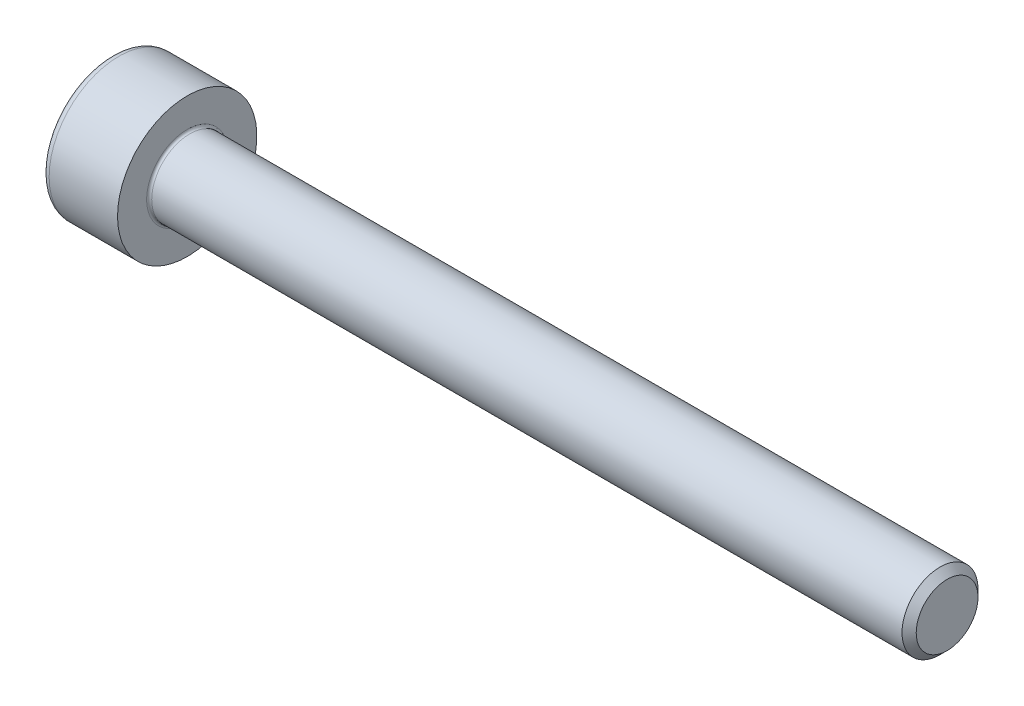
ISO-10303-21;
HEADER;
FILE_DESCRIPTION(('STEP AP214'),'2;1');
FILE_NAME('part.step','',(''),(''),'','','');
FILE_SCHEMA(('AUTOMOTIVE_DESIGN { 1 0 10303 214 1 1 1 1 }'));
ENDSEC;
DATA;
#1=APPLICATION_CONTEXT('core data for automotive mechanical design processes');
#2=APPLICATION_PROTOCOL_DEFINITION('international standard','automotive_design',2000,#1);
#3=PRODUCT_CONTEXT('',#1,'mechanical');
#4=PRODUCT('Part','Part','',(#3));
#5=PRODUCT_RELATED_PRODUCT_CATEGORY('part','',(#4));
#6=PRODUCT_DEFINITION_FORMATION('','',#4);
#7=PRODUCT_DEFINITION_CONTEXT('part definition',#1,'design');
#8=PRODUCT_DEFINITION('design','',#6,#7);
#9=PRODUCT_DEFINITION_SHAPE('','',#8);
#10=(LENGTH_UNIT() NAMED_UNIT(*) SI_UNIT(.MILLI.,.METRE.));
#11=(NAMED_UNIT(*) PLANE_ANGLE_UNIT() SI_UNIT($,.RADIAN.));
#12=(NAMED_UNIT(*) SI_UNIT($,.STERADIAN.) SOLID_ANGLE_UNIT());
#13=UNCERTAINTY_MEASURE_WITH_UNIT(LENGTH_MEASURE(1.E-05),#10,'distance_accuracy_value','');
#14=(GEOMETRIC_REPRESENTATION_CONTEXT(3) GLOBAL_UNCERTAINTY_ASSIGNED_CONTEXT((#13)) GLOBAL_UNIT_ASSIGNED_CONTEXT((#10,
#11,#12)) REPRESENTATION_CONTEXT('',''));
#15=CARTESIAN_POINT('',(0.,0.,0.));
#16=DIRECTION('',(0.,0.,1.));
#17=DIRECTION('',(1.,0.,0.));
#18=AXIS2_PLACEMENT_3D('',#15,#16,#17);
#19=CARTESIAN_POINT('',(0.,0.,0.));
#20=DIRECTION('',(-1.,0.,0.));
#21=DIRECTION('',(0.,0.,1.));
#22=AXIS2_PLACEMENT_3D('',#19,#20,#21);
#23=PLANE('',#22);
#24=DIRECTION('',(0.,-0.499999999999999,0.866025403784439));
#25=VECTOR('',#24,1.);
#26=CARTESIAN_POINT('',(0.,1.45492267835785,0.));
#27=LINE('',#26,#25);
#28=CARTESIAN_POINT('',(0.,1.45492267835785,0.));
#29=VERTEX_POINT('',#28);
#30=CARTESIAN_POINT('',(0.,0.727461339178922,1.26));
#31=VERTEX_POINT('',#30);
#32=EDGE_CURVE('E259',#29,#31,#27,.T.);
#33=ORIENTED_EDGE('',*,*,#32,.T.);
#34=DIRECTION('',(0.,1.,0.));
#35=VECTOR('',#34,1.);
#36=CARTESIAN_POINT('',(0.,-0.727461339178934,1.26));
#37=LINE('',#36,#35);
#38=CARTESIAN_POINT('',(0.,-0.727461339178934,1.26));
#39=VERTEX_POINT('',#38);
#40=EDGE_CURVE('E131',#39,#31,#37,.T.);
#41=ORIENTED_EDGE('',*,*,#40,.F.);
#42=DIRECTION('',(0.,-0.500000000000001,-0.866025403784438));
#43=VECTOR('',#42,1.);
#44=CARTESIAN_POINT('',(0.,-0.727461339178934,1.26));
#45=LINE('',#44,#43);
#46=CARTESIAN_POINT('',(0.,-1.45492267835786,0.));
#47=VERTEX_POINT('',#46);
#48=EDGE_CURVE('E262',#39,#47,#45,.T.);
#49=ORIENTED_EDGE('',*,*,#48,.T.);
#50=DIRECTION('',(0.,0.499999999999998,-0.86602540378444));
#51=VECTOR('',#50,1.);
#52=CARTESIAN_POINT('',(0.,-1.45492267835786,0.));
#53=LINE('',#52,#51);
#54=CARTESIAN_POINT('',(0.,-0.727461339178938,-1.26));
#55=VERTEX_POINT('',#54);
#56=EDGE_CURVE('E265',#47,#55,#53,.T.);
#57=ORIENTED_EDGE('',*,*,#56,.T.);
#58=DIRECTION('',(0.,-1.,0.));
#59=VECTOR('',#58,1.);
#60=CARTESIAN_POINT('',(0.,0.727461339178918,-1.26));
#61=LINE('',#60,#59);
#62=CARTESIAN_POINT('',(0.,0.727461339178918,-1.26));
#63=VERTEX_POINT('',#62);
#64=EDGE_CURVE('E268',#63,#55,#61,.T.);
#65=ORIENTED_EDGE('',*,*,#64,.F.);
#66=DIRECTION('',(0.,-0.500000000000001,-0.866025403784438));
#67=VECTOR('',#66,1.);
#68=CARTESIAN_POINT('',(0.,1.45492267835785,0.));
#69=LINE('',#68,#67);
#70=EDGE_CURVE('E126',#29,#63,#69,.T.);
#71=ORIENTED_EDGE('',*,*,#70,.F.);
#72=EDGE_LOOP('',(#33,#41,#49,#57,#65,#71));
#73=FACE_BOUND('',#72,.T.);
#74=CARTESIAN_POINT('',(0.,0.,0.));
#75=DIRECTION('',(-1.,0.,0.));
#76=DIRECTION('',(0.,0.,1.));
#77=AXIS2_PLACEMENT_3D('',#74,#75,#76);
#78=CIRCLE('',#77,2.45);
#79=CARTESIAN_POINT('',(0.,0.,2.45));
#80=VERTEX_POINT('',#79);
#81=EDGE_CURVE('E43',#80,#80,#78,.T.);
#82=ORIENTED_EDGE('',*,*,#81,.T.);
#83=EDGE_LOOP('',(#82));
#84=FACE_BOUND('',#83,.T.);
#85=ADVANCED_FACE('F35',(#73,#84),#23,.T.);
#86=CARTESIAN_POINT('',(-31.75,0.,0.));
#87=DIRECTION('',(-1.,0.,0.));
#88=DIRECTION('',(0.,0.,1.));
#89=AXIS2_PLACEMENT_3D('',#86,#87,#88);
#90=CYLINDRICAL_SURFACE('',#89,2.75);
#91=CARTESIAN_POINT('',(0.300000000000002,0.,0.));
#92=DIRECTION('',(-1.,0.,0.));
#93=DIRECTION('',(0.,0.,1.));
#94=AXIS2_PLACEMENT_3D('',#91,#92,#93);
#95=CIRCLE('',#94,2.75);
#96=CARTESIAN_POINT('',(0.300000000000002,0.,2.75));
#97=VERTEX_POINT('',#96);
#98=EDGE_CURVE('E11',#97,#97,#95,.F.);
#99=ORIENTED_EDGE('',*,*,#98,.T.);
#100=EDGE_LOOP('',(#99));
#101=FACE_BOUND('',#100,.T.);
#102=CARTESIAN_POINT('',(3.,0.,0.));
#103=DIRECTION('',(-1.,0.,0.));
#104=DIRECTION('',(0.,0.,1.));
#105=AXIS2_PLACEMENT_3D('',#102,#103,#104);
#106=CIRCLE('',#105,2.75);
#107=CARTESIAN_POINT('',(3.,0.,2.75));
#108=VERTEX_POINT('',#107);
#109=EDGE_CURVE('E149',#108,#108,#106,.T.);
#110=ORIENTED_EDGE('',*,*,#109,.T.);
#111=EDGE_LOOP('',(#110));
#112=FACE_BOUND('',#111,.T.);
#113=ADVANCED_FACE('F173',(#101,#112),#90,.T.);
#114=CARTESIAN_POINT('',(3.,2.75,0.));
#115=DIRECTION('',(1.,0.,0.));
#116=DIRECTION('',(0.,0.,-1.));
#117=AXIS2_PLACEMENT_3D('',#114,#115,#116);
#118=PLANE('',#117);
#119=CARTESIAN_POINT('',(3.,0.,0.));
#120=DIRECTION('',(1.,0.,0.));
#121=DIRECTION('',(0.,0.,-1.));
#122=AXIS2_PLACEMENT_3D('',#119,#120,#121);
#123=CIRCLE('',#122,1.59999999999995);
#124=CARTESIAN_POINT('',(3.,0.,-1.59999999999995));
#125=VERTEX_POINT('',#124);
#126=EDGE_CURVE('E152',#125,#125,#123,.F.);
#127=ORIENTED_EDGE('',*,*,#126,.T.);
#128=EDGE_LOOP('',(#127));
#129=FACE_BOUND('',#128,.T.);
#130=ORIENTED_EDGE('',*,*,#109,.F.);
#131=EDGE_LOOP('',(#130));
#132=FACE_BOUND('',#131,.T.);
#133=ADVANCED_FACE('F179',(#129,#132),#118,.T.);
#134=CARTESIAN_POINT('',(-31.75,0.,0.));
#135=DIRECTION('',(-1.,0.,0.));
#136=DIRECTION('',(0.,0.,1.));
#137=AXIS2_PLACEMENT_3D('',#134,#135,#136);
#138=CYLINDRICAL_SURFACE('',#137,1.49999999999994);
#139=CARTESIAN_POINT('',(3.1,0.,0.));
#140=DIRECTION('',(1.,0.,0.));
#141=DIRECTION('',(0.,0.,-1.));
#142=AXIS2_PLACEMENT_3D('',#139,#140,#141);
#143=CIRCLE('',#142,1.49999999999994);
#144=CARTESIAN_POINT('',(3.1,0.,-1.49999999999994));
#145=VERTEX_POINT('',#144);
#146=EDGE_CURVE('E155',#145,#145,#143,.T.);
#147=ORIENTED_EDGE('',*,*,#146,.T.);
#148=EDGE_LOOP('',(#147));
#149=FACE_BOUND('',#148,.T.);
#150=CARTESIAN_POINT('',(32.7194999999999,0.,0.));
#151=DIRECTION('',(-1.,0.,0.));
#152=DIRECTION('',(0.,0.,1.));
#153=AXIS2_PLACEMENT_3D('',#150,#151,#152);
#154=CIRCLE('',#153,1.49999999999989);
#155=CARTESIAN_POINT('',(32.7194999999999,0.,1.49999999999989));
#156=VERTEX_POINT('',#155);
#157=EDGE_CURVE('E146',#156,#156,#154,.T.);
#158=ORIENTED_EDGE('',*,*,#157,.T.);
#159=EDGE_LOOP('',(#158));
#160=FACE_BOUND('',#159,.T.);
#161=ADVANCED_FACE('F185',(#149,#160),#138,.T.);
#162=CARTESIAN_POINT('',(33.,0.,0.));
#163=DIRECTION('',(-1.,0.,0.));
#164=DIRECTION('',(0.,0.,1.));
#165=AXIS2_PLACEMENT_3D('',#162,#163,#164);
#166=CONICAL_SURFACE('',#165,1.2195,0.785398163397049);
#167=ORIENTED_EDGE('',*,*,#157,.F.);
#168=EDGE_LOOP('',(#167));
#169=FACE_BOUND('',#168,.T.);
#170=CARTESIAN_POINT('',(33.,0.,0.));
#171=DIRECTION('',(-1.,0.,0.));
#172=DIRECTION('',(0.,0.,1.));
#173=AXIS2_PLACEMENT_3D('',#170,#171,#172);
#174=CIRCLE('',#173,1.2195);
#175=CARTESIAN_POINT('',(33.,0.,1.2195));
#176=VERTEX_POINT('',#175);
#177=EDGE_CURVE('E142',#176,#176,#174,.T.);
#178=ORIENTED_EDGE('',*,*,#177,.T.);
#179=EDGE_LOOP('',(#178));
#180=FACE_BOUND('',#179,.T.);
#181=ADVANCED_FACE('F189',(#169,#180),#166,.T.);
#182=CARTESIAN_POINT('',(33.,1.2195,0.));
#183=DIRECTION('',(1.,0.,0.));
#184=DIRECTION('',(0.,0.,-1.));
#185=AXIS2_PLACEMENT_3D('',#182,#183,#184);
#186=PLANE('',#185);
#187=ORIENTED_EDGE('',*,*,#177,.F.);
#188=EDGE_LOOP('',(#187));
#189=FACE_BOUND('',#188,.T.);
#190=ADVANCED_FACE('F169',(#189),#186,.T.);
#191=CARTESIAN_POINT('',(3.1,0.,0.));
#192=DIRECTION('',(1.,0.,0.));
#193=DIRECTION('',(0.,0.,-1.));
#194=AXIS2_PLACEMENT_3D('',#191,#192,#193);
#195=TOROIDAL_SURFACE('',#194,1.59999999999995,0.1);
#196=ORIENTED_EDGE('',*,*,#146,.F.);
#197=EDGE_LOOP('',(#196));
#198=FACE_BOUND('',#197,.T.);
#199=ORIENTED_EDGE('',*,*,#126,.F.);
#200=EDGE_LOOP('',(#199));
#201=FACE_BOUND('',#200,.T.);
#202=ADVANCED_FACE('F162',(#198,#201),#195,.F.);
#203=CARTESIAN_POINT('',(0.300000000000002,0.,0.));
#204=DIRECTION('',(-1.,0.,0.));
#205=DIRECTION('',(0.,0.,1.));
#206=AXIS2_PLACEMENT_3D('',#203,#204,#205);
#207=TOROIDAL_SURFACE('',#206,2.45,0.3);
#208=ORIENTED_EDGE('',*,*,#98,.F.);
#209=EDGE_LOOP('',(#208));
#210=FACE_BOUND('',#209,.T.);
#211=ORIENTED_EDGE('',*,*,#81,.F.);
#212=EDGE_LOOP('',(#211));
#213=FACE_BOUND('',#212,.T.);
#214=ADVANCED_FACE('F37',(#210,#213),#207,.T.);
#215=CARTESIAN_POINT('',(1.3,1.45492267835785,0.));
#216=DIRECTION('',(0.,-0.866025403784439,-0.499999999999999));
#217=DIRECTION('',(0.,0.499999999999999,-0.866025403784439));
#218=AXIS2_PLACEMENT_3D('',#215,#216,#217);
#219=PLANE('',#218);
#220=ORIENTED_EDGE('',*,*,#32,.F.);
#221=DIRECTION('',(-1.,0.,0.));
#222=VECTOR('',#221,1.);
#223=CARTESIAN_POINT('',(1.3,1.45492267835785,0.));
#224=LINE('',#223,#222);
#225=CARTESIAN_POINT('',(1.3,1.45492267835785,0.));
#226=VERTEX_POINT('',#225);
#227=EDGE_CURVE('E249',#226,#29,#224,.T.);
#228=ORIENTED_EDGE('',*,*,#227,.F.);
#229=DIRECTION('',(0.,-0.499999999999999,0.866025403784439));
#230=VECTOR('',#229,1.);
#231=CARTESIAN_POINT('',(1.3,1.45492267835785,0.));
#232=LINE('',#231,#230);
#233=CARTESIAN_POINT('',(1.3,1.09119200876839,0.629999999999996));
#234=VERTEX_POINT('',#233);
#235=EDGE_CURVE('E118',#226,#234,#232,.T.);
#236=ORIENTED_EDGE('',*,*,#235,.T.);
#237=CARTESIAN_POINT('',(1.3,0.727461339178922,1.26));
#238=VERTEX_POINT('',#237);
#239=EDGE_CURVE('E109',#234,#238,#232,.T.);
#240=ORIENTED_EDGE('',*,*,#239,.T.);
#241=DIRECTION('',(-1.,0.,0.));
#242=VECTOR('',#241,1.);
#243=CARTESIAN_POINT('',(1.3,0.727461339178922,1.26));
#244=LINE('',#243,#242);
#245=EDGE_CURVE('E123',#238,#31,#244,.T.);
#246=ORIENTED_EDGE('',*,*,#245,.T.);
#247=EDGE_LOOP('',(#220,#228,#236,#240,#246));
#248=FACE_BOUND('',#247,.T.);
#249=ADVANCED_FACE('F122',(#248),#219,.T.);
#250=CARTESIAN_POINT('',(1.3,-0.727461339178934,1.26));
#251=DIRECTION('',(0.,0.,1.));
#252=DIRECTION('',(0.,-1.,0.));
#253=AXIS2_PLACEMENT_3D('',#250,#251,#252);
#254=PLANE('',#253);
#255=ORIENTED_EDGE('',*,*,#40,.T.);
#256=ORIENTED_EDGE('',*,*,#245,.F.);
#257=DIRECTION('',(0.,1.,0.));
#258=VECTOR('',#257,1.);
#259=CARTESIAN_POINT('',(1.3,-0.727461339178934,1.26));
#260=LINE('',#259,#258);
#261=CARTESIAN_POINT('',(1.3,0.,1.26));
#262=VERTEX_POINT('',#261);
#263=EDGE_CURVE('E106',#262,#238,#260,.T.);
#264=ORIENTED_EDGE('',*,*,#263,.F.);
#265=CARTESIAN_POINT('',(1.3,-0.727461339178934,1.26));
#266=VERTEX_POINT('',#265);
#267=EDGE_CURVE('E117',#266,#262,#260,.T.);
#268=ORIENTED_EDGE('',*,*,#267,.F.);
#269=DIRECTION('',(-1.,0.,0.));
#270=VECTOR('',#269,1.);
#271=CARTESIAN_POINT('',(1.3,-0.727461339178934,1.26));
#272=LINE('',#271,#270);
#273=EDGE_CURVE('E133',#266,#39,#272,.T.);
#274=ORIENTED_EDGE('',*,*,#273,.T.);
#275=EDGE_LOOP('',(#255,#256,#264,#268,#274));
#276=FACE_BOUND('',#275,.T.);
#277=ADVANCED_FACE('F128',(#276),#254,.F.);
#278=CARTESIAN_POINT('',(1.3,-0.727461339178934,1.26));
#279=DIRECTION('',(0.,0.866025403784438,-0.500000000000001));
#280=DIRECTION('',(0.,0.500000000000001,0.866025403784438));
#281=AXIS2_PLACEMENT_3D('',#278,#279,#280);
#282=PLANE('',#281);
#283=ORIENTED_EDGE('',*,*,#48,.F.);
#284=ORIENTED_EDGE('',*,*,#273,.F.);
#285=DIRECTION('',(0.,-0.500000000000001,-0.866025403784438));
#286=VECTOR('',#285,1.);
#287=CARTESIAN_POINT('',(1.3,-0.727461339178934,1.26));
#288=LINE('',#287,#286);
#289=CARTESIAN_POINT('',(1.3,-1.0911920087684,0.630000000000005));
#290=VERTEX_POINT('',#289);
#291=EDGE_CURVE('E288',#266,#290,#288,.T.);
#292=ORIENTED_EDGE('',*,*,#291,.T.);
#293=CARTESIAN_POINT('',(1.3,-1.45492267835786,0.));
#294=VERTEX_POINT('',#293);
#295=EDGE_CURVE('E277',#290,#294,#288,.T.);
#296=ORIENTED_EDGE('',*,*,#295,.T.);
#297=DIRECTION('',(-1.,0.,0.));
#298=VECTOR('',#297,1.);
#299=CARTESIAN_POINT('',(1.3,-1.45492267835786,0.));
#300=LINE('',#299,#298);
#301=EDGE_CURVE('E138',#294,#47,#300,.T.);
#302=ORIENTED_EDGE('',*,*,#301,.T.);
#303=EDGE_LOOP('',(#283,#284,#292,#296,#302));
#304=FACE_BOUND('',#303,.T.);
#305=ADVANCED_FACE('F203',(#304),#282,.T.);
#306=CARTESIAN_POINT('',(1.3,-1.45492267835786,0.));
#307=DIRECTION('',(0.,0.86602540378444,0.499999999999998));
#308=DIRECTION('',(0.,-0.499999999999998,0.86602540378444));
#309=AXIS2_PLACEMENT_3D('',#306,#307,#308);
#310=PLANE('',#309);
#311=ORIENTED_EDGE('',*,*,#56,.F.);
#312=ORIENTED_EDGE('',*,*,#301,.F.);
#313=DIRECTION('',(0.,0.499999999999998,-0.86602540378444));
#314=VECTOR('',#313,1.);
#315=CARTESIAN_POINT('',(1.3,-1.45492267835786,0.));
#316=LINE('',#315,#314);
#317=CARTESIAN_POINT('',(1.3,-1.0911920087684,-0.63));
#318=VERTEX_POINT('',#317);
#319=EDGE_CURVE('E255',#294,#318,#316,.T.);
#320=ORIENTED_EDGE('',*,*,#319,.T.);
#321=CARTESIAN_POINT('',(1.3,-0.727461339178938,-1.26));
#322=VERTEX_POINT('',#321);
#323=EDGE_CURVE('E287',#318,#322,#316,.T.);
#324=ORIENTED_EDGE('',*,*,#323,.T.);
#325=DIRECTION('',(-1.,0.,0.));
#326=VECTOR('',#325,1.);
#327=CARTESIAN_POINT('',(1.3,-0.727461339178938,-1.26));
#328=LINE('',#327,#326);
#329=EDGE_CURVE('E248',#322,#55,#328,.T.);
#330=ORIENTED_EDGE('',*,*,#329,.T.);
#331=EDGE_LOOP('',(#311,#312,#320,#324,#330));
#332=FACE_BOUND('',#331,.T.);
#333=ADVANCED_FACE('F206',(#332),#310,.T.);
#334=CARTESIAN_POINT('',(1.3,0.727461339178918,-1.26));
#335=DIRECTION('',(0.,0.,-1.));
#336=DIRECTION('',(0.,1.,0.));
#337=AXIS2_PLACEMENT_3D('',#334,#335,#336);
#338=PLANE('',#337);
#339=ORIENTED_EDGE('',*,*,#64,.T.);
#340=ORIENTED_EDGE('',*,*,#329,.F.);
#341=DIRECTION('',(0.,-1.,0.));
#342=VECTOR('',#341,1.);
#343=CARTESIAN_POINT('',(1.3,0.727461339178918,-1.26));
#344=LINE('',#343,#342);
#345=CARTESIAN_POINT('',(1.3,0.,-1.26));
#346=VERTEX_POINT('',#345);
#347=EDGE_CURVE('E252',#346,#322,#344,.T.);
#348=ORIENTED_EDGE('',*,*,#347,.F.);
#349=CARTESIAN_POINT('',(1.3,0.727461339178918,-1.26));
#350=VERTEX_POINT('',#349);
#351=EDGE_CURVE('E50',#350,#346,#344,.T.);
#352=ORIENTED_EDGE('',*,*,#351,.F.);
#353=DIRECTION('',(-1.,0.,0.));
#354=VECTOR('',#353,1.);
#355=CARTESIAN_POINT('',(1.3,0.727461339178918,-1.26));
#356=LINE('',#355,#354);
#357=EDGE_CURVE('E245',#350,#63,#356,.T.);
#358=ORIENTED_EDGE('',*,*,#357,.T.);
#359=EDGE_LOOP('',(#339,#340,#348,#352,#358));
#360=FACE_BOUND('',#359,.T.);
#361=ADVANCED_FACE('F210',(#360),#338,.F.);
#362=CARTESIAN_POINT('',(1.3,1.45492267835785,0.));
#363=DIRECTION('',(0.,0.866025403784438,-0.500000000000001));
#364=DIRECTION('',(0.,0.500000000000001,0.866025403784438));
#365=AXIS2_PLACEMENT_3D('',#362,#363,#364);
#366=PLANE('',#365);
#367=ORIENTED_EDGE('',*,*,#70,.T.);
#368=ORIENTED_EDGE('',*,*,#357,.F.);
#369=DIRECTION('',(0.,-0.500000000000001,-0.866025403784438));
#370=VECTOR('',#369,1.);
#371=CARTESIAN_POINT('',(1.3,1.45492267835785,0.));
#372=LINE('',#371,#370);
#373=CARTESIAN_POINT('',(1.3,1.09119200876838,-0.629999999999997));
#374=VERTEX_POINT('',#373);
#375=EDGE_CURVE('E235',#374,#350,#372,.T.);
#376=ORIENTED_EDGE('',*,*,#375,.F.);
#377=EDGE_CURVE('E241',#226,#374,#372,.T.);
#378=ORIENTED_EDGE('',*,*,#377,.F.);
#379=ORIENTED_EDGE('',*,*,#227,.T.);
#380=EDGE_LOOP('',(#367,#368,#376,#378,#379));
#381=FACE_BOUND('',#380,.T.);
#382=ADVANCED_FACE('F214',(#381),#366,.F.);
#383=CARTESIAN_POINT('',(1.3,2.18238401753677,-1.26));
#384=DIRECTION('',(1.,0.,0.));
#385=DIRECTION('',(0.,0.,-1.));
#386=AXIS2_PLACEMENT_3D('',#383,#384,#385);
#387=PLANE('',#386);
#388=ORIENTED_EDGE('',*,*,#347,.T.);
#389=ORIENTED_EDGE('',*,*,#323,.F.);
#390=CARTESIAN_POINT('',(1.3,0.,0.));
#391=DIRECTION('',(-1.,0.,0.));
#392=DIRECTION('',(0.,0.,1.));
#393=AXIS2_PLACEMENT_3D('',#390,#391,#392);
#394=CIRCLE('',#393,1.26);
#395=EDGE_CURVE('E283',#346,#318,#394,.T.);
#396=ORIENTED_EDGE('',*,*,#395,.F.);
#397=EDGE_LOOP('',(#388,#389,#396));
#398=FACE_BOUND('',#397,.T.);
#399=ADVANCED_FACE('F218',(#398),#387,.F.);
#400=ORIENTED_EDGE('',*,*,#319,.F.);
#401=ORIENTED_EDGE('',*,*,#295,.F.);
#402=EDGE_CURVE('E136',#318,#290,#394,.T.);
#403=ORIENTED_EDGE('',*,*,#402,.F.);
#404=EDGE_LOOP('',(#400,#401,#403));
#405=FACE_BOUND('',#404,.T.);
#406=ADVANCED_FACE('F221',(#405),#387,.F.);
#407=ORIENTED_EDGE('',*,*,#291,.F.);
#408=ORIENTED_EDGE('',*,*,#267,.T.);
#409=EDGE_CURVE('E132',#290,#262,#394,.T.);
#410=ORIENTED_EDGE('',*,*,#409,.F.);
#411=EDGE_LOOP('',(#407,#408,#410));
#412=FACE_BOUND('',#411,.T.);
#413=ADVANCED_FACE('F226',(#412),#387,.F.);
#414=ORIENTED_EDGE('',*,*,#263,.T.);
#415=ORIENTED_EDGE('',*,*,#239,.F.);
#416=EDGE_CURVE('E112',#262,#234,#394,.T.);
#417=ORIENTED_EDGE('',*,*,#416,.F.);
#418=EDGE_LOOP('',(#414,#415,#417));
#419=FACE_BOUND('',#418,.T.);
#420=ADVANCED_FACE('F108',(#419),#387,.F.);
#421=ORIENTED_EDGE('',*,*,#235,.F.);
#422=ORIENTED_EDGE('',*,*,#377,.T.);
#423=EDGE_CURVE('E143',#234,#374,#394,.T.);
#424=ORIENTED_EDGE('',*,*,#423,.F.);
#425=EDGE_LOOP('',(#421,#422,#424));
#426=FACE_BOUND('',#425,.T.);
#427=ADVANCED_FACE('F229',(#426),#387,.F.);
#428=ORIENTED_EDGE('',*,*,#375,.T.);
#429=ORIENTED_EDGE('',*,*,#351,.T.);
#430=EDGE_CURVE('E238',#374,#346,#394,.T.);
#431=ORIENTED_EDGE('',*,*,#430,.F.);
#432=EDGE_LOOP('',(#428,#429,#431));
#433=FACE_BOUND('',#432,.T.);
#434=ADVANCED_FACE('F199',(#433),#387,.F.);
#435=CARTESIAN_POINT('',(1.3,0.,0.));
#436=DIRECTION('',(-1.,0.,0.));
#437=DIRECTION('',(0.,0.,1.));
#438=AXIS2_PLACEMENT_3D('',#435,#436,#437);
#439=CONICAL_SURFACE('',#438,1.26,1.04719755119659);
#440=CARTESIAN_POINT('',(2.02746133917894,0.,0.));
#441=VERTEX_POINT('',#440);
#442=VERTEX_LOOP('',#441);
#443=FACE_BOUND('',#442,.T.);
#444=ORIENTED_EDGE('',*,*,#416,.T.);
#445=ORIENTED_EDGE('',*,*,#423,.T.);
#446=ORIENTED_EDGE('',*,*,#430,.T.);
#447=ORIENTED_EDGE('',*,*,#395,.T.);
#448=ORIENTED_EDGE('',*,*,#402,.T.);
#449=ORIENTED_EDGE('',*,*,#409,.T.);
#450=EDGE_LOOP('',(#444,#445,#446,#447,#448,#449));
#451=FACE_BOUND('',#450,.T.);
#452=ADVANCED_FACE('F197',(#443,#451),#439,.F.);
#453=CLOSED_SHELL('',(#85,#113,#133,#161,#181,#190,#202,#214,#249,#277,#305,#333,#361,#382,#399,
#406,#413,#420,#427,#434,#452));
#454=MANIFOLD_SOLID_BREP('B2',#453);
#455=ADVANCED_BREP_SHAPE_REPRESENTATION('',(#18,#454),#14);
#456=SHAPE_DEFINITION_REPRESENTATION(#9,#455);
ENDSEC;
END-ISO-10303-21;
